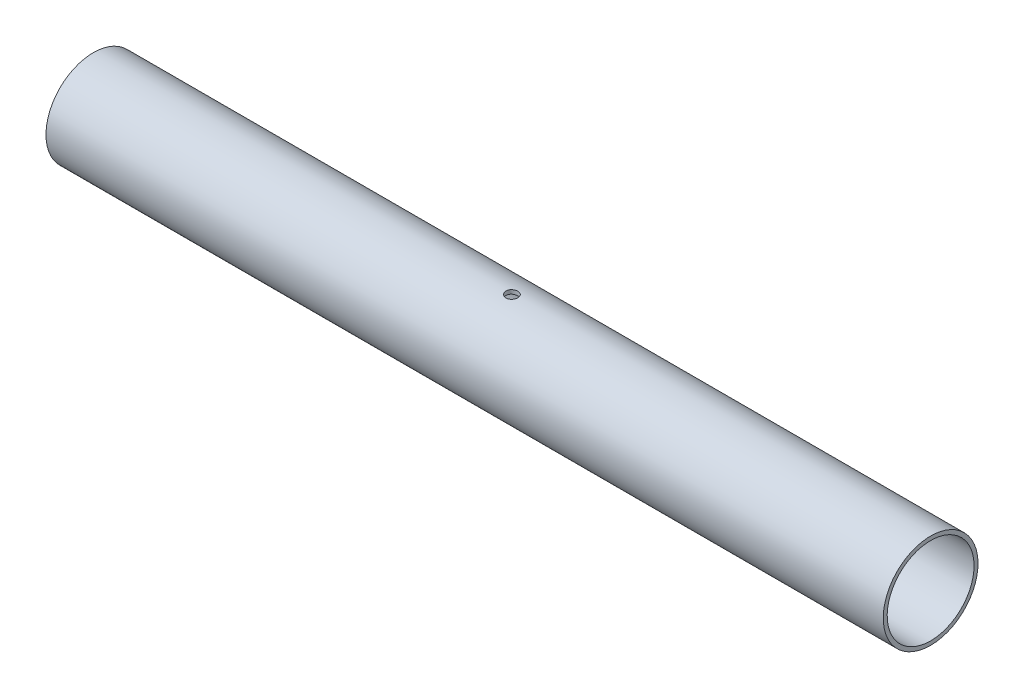
ISO-10303-21;
HEADER;
FILE_DESCRIPTION(('STEP AP214'),'2;1');
FILE_NAME('part.step','',(''),(''),'','','');
FILE_SCHEMA(('AUTOMOTIVE_DESIGN { 1 0 10303 214 1 1 1 1 }'));
ENDSEC;
DATA;
#1=APPLICATION_CONTEXT('core data for automotive mechanical design processes');
#2=APPLICATION_PROTOCOL_DEFINITION('international standard','automotive_design',2000,#1);
#3=PRODUCT_CONTEXT('',#1,'mechanical');
#4=PRODUCT('Part','Part','',(#3));
#5=PRODUCT_RELATED_PRODUCT_CATEGORY('part','',(#4));
#6=PRODUCT_DEFINITION_FORMATION('','',#4);
#7=PRODUCT_DEFINITION_CONTEXT('part definition',#1,'design');
#8=PRODUCT_DEFINITION('design','',#6,#7);
#9=PRODUCT_DEFINITION_SHAPE('','',#8);
#10=(LENGTH_UNIT() NAMED_UNIT(*) SI_UNIT(.MILLI.,.METRE.));
#11=(NAMED_UNIT(*) PLANE_ANGLE_UNIT() SI_UNIT($,.RADIAN.));
#12=(NAMED_UNIT(*) SI_UNIT($,.STERADIAN.) SOLID_ANGLE_UNIT());
#13=UNCERTAINTY_MEASURE_WITH_UNIT(LENGTH_MEASURE(1.E-05),#10,'distance_accuracy_value','');
#14=(GEOMETRIC_REPRESENTATION_CONTEXT(3) GLOBAL_UNCERTAINTY_ASSIGNED_CONTEXT((#13)) GLOBAL_UNIT_ASSIGNED_CONTEXT((#10,
#11,#12)) REPRESENTATION_CONTEXT('',''));
#15=CARTESIAN_POINT('',(0.,0.,0.));
#16=DIRECTION('',(0.,0.,1.));
#17=DIRECTION('',(1.,0.,0.));
#18=AXIS2_PLACEMENT_3D('',#15,#16,#17);
#19=CARTESIAN_POINT('',(90.4720943613365,105.869562715765,50.0000000000016));
#20=DIRECTION('',(-1.,0.,0.));
#21=DIRECTION('',(0.,-1.,0.));
#22=AXIS2_PLACEMENT_3D('',#19,#20,#21);
#23=CYLINDRICAL_SURFACE('',#22,12.);
#24=CARTESIAN_POINT('',(-17.0279056386635,93.869562715765,50.0000000000016));
#25=CARTESIAN_POINT('',(-17.027902074102,93.8695638863865,49.9160953426682));
#26=CARTESIAN_POINT('',(-17.0208419111619,93.8704520084356,49.83213825542));
#27=CARTESIAN_POINT('',(-16.992788985921,93.8739094750969,49.6665603187478));
#28=CARTESIAN_POINT('',(-16.9717816759094,93.8764805751165,49.5849420016274));
#29=CARTESIAN_POINT('',(-16.916463052315,93.8830143494986,49.4264626551138));
#30=CARTESIAN_POINT('',(-16.8821606935775,93.8869760870318,49.3495984639139));
#31=CARTESIAN_POINT('',(-16.8012452682816,93.8958505104965,49.2027323150658));
#32=CARTESIAN_POINT('',(-16.754634313545,93.9007630332604,49.1327291830678));
#33=CARTESIAN_POINT('',(-16.6501504687597,93.9110207879271,49.0011723098428));
#34=CARTESIAN_POINT('',(-16.5922233610557,93.9163680276106,48.9396617810393));
#35=CARTESIAN_POINT('',(-16.4668679445415,93.9268763597066,48.8272083238671));
#36=CARTESIAN_POINT('',(-16.3994391517155,93.9320374426194,48.7762659341663));
#37=CARTESIAN_POINT('',(-16.2567136521241,93.9416088820475,48.6862339032312));
#38=CARTESIAN_POINT('',(-16.1813912217227,93.9460166526976,48.647184742437));
#39=CARTESIAN_POINT('',(-16.025193407495,93.9535559450189,48.5823061540565));
#40=CARTESIAN_POINT('',(-15.9443182343753,93.9566875150862,48.5564762251625));
#41=CARTESIAN_POINT('',(-15.7797591213114,93.9613006781434,48.5189006119868));
#42=CARTESIAN_POINT('',(-15.696092084041,93.9627908151446,48.5070819711626));
#43=CARTESIAN_POINT('',(-15.5279498805804,93.9639785469083,48.4976386702673));
#44=CARTESIAN_POINT('',(-15.4434747470247,93.963676213756,48.5000134394002));
#45=CARTESIAN_POINT('',(-15.2766227423142,93.9613209835466,48.5188296581329));
#46=CARTESIAN_POINT('',(-15.1942366469433,93.9592780880031,48.5351907422108));
#47=CARTESIAN_POINT('',(-15.0333886259321,93.9536875172193,48.5813897700924));
#48=CARTESIAN_POINT('',(-14.954926779835,93.9501398114907,48.6112279869505));
#49=CARTESIAN_POINT('',(-14.8039048392505,93.9419280205772,48.6836206640546));
#50=CARTESIAN_POINT('',(-14.7313616585141,93.9372608764964,48.726210047777));
#51=CARTESIAN_POINT('',(-14.5944216220155,93.9273384471815,48.8228711183275));
#52=CARTESIAN_POINT('',(-14.5300251390793,93.9220831350511,48.8769433303531));
#53=CARTESIAN_POINT('',(-14.4107400122298,93.9115320564225,48.9954805335493));
#54=CARTESIAN_POINT('',(-14.3559201836039,93.9062362614437,49.0600147952976));
#55=CARTESIAN_POINT('',(-14.2578803106451,93.8962349204299,49.1974056985333));
#56=CARTESIAN_POINT('',(-14.2146602930603,93.891529375756,49.2702623592107));
#57=CARTESIAN_POINT('',(-14.1410468463851,93.8832358024536,49.4222829971835));
#58=CARTESIAN_POINT('',(-14.1106577263347,93.8796481493558,49.501449082799));
#59=CARTESIAN_POINT('',(-14.0636233425495,93.8739980010847,49.663815235743));
#60=CARTESIAN_POINT('',(-14.0469774353812,93.8719354345098,49.7470151140232));
#61=CARTESIAN_POINT('',(-14.0279911841071,93.8695771373005,49.9144921016535));
#62=CARTESIAN_POINT('',(-14.025556043245,93.8692696989092,49.9987583058824));
#63=CARTESIAN_POINT('',(-14.034810279097,93.8704246877325,50.1664976219001));
#64=CARTESIAN_POINT('',(-14.0464993550144,93.8718870772558,50.2499707505404));
#65=CARTESIAN_POINT('',(-14.0835914639281,93.8764101032249,50.4134747046345));
#66=CARTESIAN_POINT('',(-14.108949296705,93.8794654708818,50.4935159422564));
#67=CARTESIAN_POINT('',(-14.1726121098112,93.8868323771639,50.6482097929167));
#68=CARTESIAN_POINT('',(-14.2109175297583,93.8911439584413,50.7228622228808));
#69=CARTESIAN_POINT('',(-14.2996175211679,93.9005717783044,50.8650827124141));
#70=CARTESIAN_POINT('',(-14.3500734125468,93.90569205151,50.9326122559679));
#71=CARTESIAN_POINT('',(-14.461555337184,93.9161518618111,51.0582781937774));
#72=CARTESIAN_POINT('',(-14.5225817900141,93.9214914076037,51.1164142150037));
#73=CARTESIAN_POINT('',(-14.6538900887177,93.9318240829896,51.2219791752924));
#74=CARTESIAN_POINT('',(-14.7242226464497,93.9368150674371,51.2693452763424));
#75=CARTESIAN_POINT('',(-14.8719005855763,93.9458502495421,51.3515917336677));
#76=CARTESIAN_POINT('',(-14.9492458263494,93.9498944661789,51.3864723402386));
#77=CARTESIAN_POINT('',(-15.108550830152,93.9565636134071,51.4426559473215));
#78=CARTESIAN_POINT('',(-15.1904979366922,93.9591922446563,51.4639943764759));
#79=CARTESIAN_POINT('',(-15.3568471289319,93.9627432203203,51.4926019963223));
#80=CARTESIAN_POINT('',(-15.4412491002389,93.9636656441124,51.4998718415231));
#81=CARTESIAN_POINT('',(-15.6094869961863,93.9636974538703,51.5001239216525));
#82=CARTESIAN_POINT('',(-15.6933227876626,93.9628193672533,51.4932048786212));
#83=CARTESIAN_POINT('',(-15.8586299162705,93.9593760285418,51.4654846429112));
#84=CARTESIAN_POINT('',(-15.9401012531487,93.9568107762666,51.4446834487451));
#85=CARTESIAN_POINT('',(-16.0983538127233,93.9502860211177,51.3898202442154));
#86=CARTESIAN_POINT('',(-16.1751367056765,93.9463270182084,51.3557629885842));
#87=CARTESIAN_POINT('',(-16.3219136310924,93.9374600162961,51.2753641412918));
#88=CARTESIAN_POINT('',(-16.3919075784754,93.9325520054026,51.2290223957074));
#89=CARTESIAN_POINT('',(-16.5236243738677,93.9222990872516,51.1250037987611));
#90=CARTESIAN_POINT('',(-16.5852889152364,93.9169514832609,51.0672533754666));
#91=CARTESIAN_POINT('',(-16.6980897337642,93.9064457262077,50.9422101361826));
#92=CARTESIAN_POINT('',(-16.749223525128,93.9012876181115,50.8749150734866));
#93=CARTESIAN_POINT('',(-16.8396768529266,93.8917203762446,50.7323993725141));
#94=CARTESIAN_POINT('',(-16.878950722203,93.8873141652953,50.6571495677593));
#95=CARTESIAN_POINT('',(-16.9442483844132,93.8797768213047,50.5011097413824));
#96=CARTESIAN_POINT('',(-16.9702865744755,93.8766443035476,50.4203258485238));
#97=CARTESIAN_POINT('',(-17.0021412415662,93.8727623937986,50.2826034631824));
#98=CARTESIAN_POINT('',(-17.0117890038527,93.8715683603923,50.2265333981118));
#99=CARTESIAN_POINT('',(-17.0246723860794,93.8699681277899,50.1136502379291));
#100=CARTESIAN_POINT('',(-17.027908053303,93.8695619227842,50.0568371482992));
#101=CARTESIAN_POINT('',(-17.0279056386635,93.869562715765,50.0000000000016));
#102=B_SPLINE_CURVE_WITH_KNOTS('',3,(#24,#25,#26,#27,#28,#29,#30,#31,#32,#33,#34,#35,#36,#37,
#38,#39,#40,#41,#42,#43,#44,#45,#46,#47,#48,#49,#50,#51,#52,#53,#54,#55,#56,#57,#58,#59,#60,#61,
#62,#63,#64,#65,#66,#67,#68,#69,#70,#71,#72,#73,#74,#75,#76,#77,#78,#79,#80,#81,#82,#83,#84,#85,
#86,#87,#88,#89,#90,#91,#92,#93,#94,#95,#96,#97,#98,#99,#100,#101),.UNSPECIFIED.,.T.,.F.,(4,2,2,
2,2,2,2,2,2,2,2,2,2,2,2,2,2,2,2,2,2,2,2,2,2,2,2,2,2,2,2,2,2,2,2,2,2,2,4),(0.,0.251506363665746,
0.503275476566053,0.754875304909059,1.00643199354644,1.25922487921105,1.51203064680006,
1.76568750191322,2.01933473698084,2.27165535171792,2.52396581930798,2.77483617865015,
3.02571162099744,3.2772805577132,3.52886100308183,3.7821808688185,4.03550131867868,
4.28890677438963,4.54230036542268,4.79400167635153,5.04569762701157,5.29656632336038,
5.54744353847369,5.79961441757054,6.05179530825053,6.30541182904544,6.55902326532923,
6.81196844568555,7.06490185806374,7.31608140721328,7.56726098327729,7.81835054823893,
8.06944325947358,8.32221142615098,8.57503919082007,8.82882841822112,9.0823409921042,
9.25271305912577,9.42308386980263),.UNSPECIFIED.);
#103=CARTESIAN_POINT('',(-17.0279056386635,93.869562715765,50.0000000000016));
#104=VERTEX_POINT('',#103);
#105=EDGE_CURVE('E87',#104,#104,#102,.T.);
#106=ORIENTED_EDGE('',*,*,#105,.F.);
#107=EDGE_LOOP('',(#106));
#108=FACE_BOUND('',#107,.T.);
#109=CARTESIAN_POINT('',(-17.0279056386635,117.869562715765,50.0000000000016));
#110=CARTESIAN_POINT('',(-17.027902074102,117.869561545144,50.0839046573351));
#111=CARTESIAN_POINT('',(-17.0208419111619,117.868673423094,50.1678617445833));
#112=CARTESIAN_POINT('',(-16.992788985921,117.865215956433,50.3334396812555));
#113=CARTESIAN_POINT('',(-16.9717816759094,117.862644856414,50.4150579983759));
#114=CARTESIAN_POINT('',(-16.916463052315,117.856111082031,50.5735373448894));
#115=CARTESIAN_POINT('',(-16.8821606935775,117.852149344498,50.6504015360893));
#116=CARTESIAN_POINT('',(-16.8012452682816,117.843274921034,50.7972676849374));
#117=CARTESIAN_POINT('',(-16.754634313545,117.83836239827,50.8672708169354));
#118=CARTESIAN_POINT('',(-16.6501504687597,117.828104643603,50.9988276901604));
#119=CARTESIAN_POINT('',(-16.5922233610557,117.82275740392,51.0603382189639));
#120=CARTESIAN_POINT('',(-16.4668679445415,117.812249071824,51.1727916761361));
#121=CARTESIAN_POINT('',(-16.3994391517155,117.807087988911,51.223734065837));
#122=CARTESIAN_POINT('',(-16.2567136521241,117.797516549483,51.313766096772));
#123=CARTESIAN_POINT('',(-16.1813912217227,117.793108778833,51.3528152575663));
#124=CARTESIAN_POINT('',(-16.0251934074951,117.785569486511,51.4176938459467));
#125=CARTESIAN_POINT('',(-15.9443182343753,117.782437916444,51.4435237748407));
#126=CARTESIAN_POINT('',(-15.7797591213114,117.777824753387,51.4810993880165));
#127=CARTESIAN_POINT('',(-15.696092084041,117.776334616386,51.4929180288406));
#128=CARTESIAN_POINT('',(-15.5279498805804,117.775146884622,51.5023613297359));
#129=CARTESIAN_POINT('',(-15.4434747470247,117.775449217774,51.4999865606031));
#130=CARTESIAN_POINT('',(-15.2766227423142,117.777804447984,51.4811703418704));
#131=CARTESIAN_POINT('',(-15.1942366469433,117.779847343527,51.4648092577924));
#132=CARTESIAN_POINT('',(-15.0333886259321,117.785437914311,51.4186102299108));
#133=CARTESIAN_POINT('',(-14.954926779835,117.788985620039,51.3887720130528));
#134=CARTESIAN_POINT('',(-14.8039048392505,117.797197410953,51.3163793359486));
#135=CARTESIAN_POINT('',(-14.7313616585141,117.801864555034,51.2737899522262));
#136=CARTESIAN_POINT('',(-14.5944216220155,117.811786984349,51.1771288816758));
#137=CARTESIAN_POINT('',(-14.5300251390793,117.817042296479,51.1230566696501));
#138=CARTESIAN_POINT('',(-14.4107400122298,117.827593375108,51.0045194664539));
#139=CARTESIAN_POINT('',(-14.3559201836039,117.832889170086,50.9399852047056));
#140=CARTESIAN_POINT('',(-14.2578803106451,117.8428905111,50.80259430147));
#141=CARTESIAN_POINT('',(-14.2146602930603,117.847596055774,50.7297376407926));
#142=CARTESIAN_POINT('',(-14.1410468463851,117.855889629077,50.5777170028197));
#143=CARTESIAN_POINT('',(-14.1106577263347,117.859477282174,50.4985509172042));
#144=CARTESIAN_POINT('',(-14.0636233425495,117.865127430445,50.3361847642603));
#145=CARTESIAN_POINT('',(-14.0469774353812,117.86718999702,50.25298488598));
#146=CARTESIAN_POINT('',(-14.0279911841071,117.86954829423,50.0855078983497));
#147=CARTESIAN_POINT('',(-14.025556043245,117.869855732621,50.0012416941208));
#148=CARTESIAN_POINT('',(-14.034810279097,117.868700743798,49.8335023781031));
#149=CARTESIAN_POINT('',(-14.0464993550144,117.867238354274,49.7500292494628));
#150=CARTESIAN_POINT('',(-14.0835914639281,117.862715328305,49.5865252953687));
#151=CARTESIAN_POINT('',(-14.108949296705,117.859659960648,49.5064840577468));
#152=CARTESIAN_POINT('',(-14.1726121098112,117.852293054366,49.3517902070866));
#153=CARTESIAN_POINT('',(-14.2109175297583,117.847981473089,49.2771377771224));
#154=CARTESIAN_POINT('',(-14.2996175211679,117.838553653226,49.1349172875892));
#155=CARTESIAN_POINT('',(-14.3500734125468,117.83343338002,49.0673877440353));
#156=CARTESIAN_POINT('',(-14.461555337184,117.822973569719,48.9417218062258));
#157=CARTESIAN_POINT('',(-14.5225817900141,117.817634023926,48.8835857849995));
#158=CARTESIAN_POINT('',(-14.6538900887177,117.807301348541,48.7780208247108));
#159=CARTESIAN_POINT('',(-14.7242226464497,117.802310364093,48.7306547236609));
#160=CARTESIAN_POINT('',(-14.8719005855763,117.793275181988,48.6484082663355));
#161=CARTESIAN_POINT('',(-14.9492458263494,117.789230965351,48.6135276597646));
#162=CARTESIAN_POINT('',(-15.108550830152,117.782561818123,48.5573440526817));
#163=CARTESIAN_POINT('',(-15.1904979366922,117.779933186874,48.5360056235273));
#164=CARTESIAN_POINT('',(-15.3568471289319,117.77638221121,48.5073980036809));
#165=CARTESIAN_POINT('',(-15.4412491002389,117.775459787418,48.5001281584802));
#166=CARTESIAN_POINT('',(-15.6094869961863,117.77542797766,48.4998760783507));
#167=CARTESIAN_POINT('',(-15.6933227876626,117.776306064277,48.506795121382));
#168=CARTESIAN_POINT('',(-15.8586299162705,117.779749402988,48.534515357092));
#169=CARTESIAN_POINT('',(-15.9401012531487,117.782314655264,48.5553165512581));
#170=CARTESIAN_POINT('',(-16.0983538127233,117.788839410412,48.6101797557878));
#171=CARTESIAN_POINT('',(-16.1751367056765,117.792798413322,48.6442370114191));
#172=CARTESIAN_POINT('',(-16.3219136310924,117.801665415234,48.7246358587114));
#173=CARTESIAN_POINT('',(-16.3919075784754,117.806573426127,48.7709776042959));
#174=CARTESIAN_POINT('',(-16.5236243738678,117.816826344278,48.8749962012421));
#175=CARTESIAN_POINT('',(-16.5852889152365,117.822173948269,48.9327466245366));
#176=CARTESIAN_POINT('',(-16.6980897337642,117.832679705322,49.0577898638206));
#177=CARTESIAN_POINT('',(-16.749223525128,117.837837813419,49.1250849265167));
#178=CARTESIAN_POINT('',(-16.8396768529266,117.847405055286,49.2676006274891));
#179=CARTESIAN_POINT('',(-16.878950722203,117.851811266235,49.3428504322439));
#180=CARTESIAN_POINT('',(-16.9442483844132,117.859348610225,49.4988902586208));
#181=CARTESIAN_POINT('',(-16.9702865744755,117.862481127982,49.5796741514795));
#182=CARTESIAN_POINT('',(-17.0021412415662,117.866363037732,49.7173965368209));
#183=CARTESIAN_POINT('',(-17.0117890038527,117.867557071138,49.7734666018915));
#184=CARTESIAN_POINT('',(-17.0246723860794,117.86915730374,49.8863497620741));
#185=CARTESIAN_POINT('',(-17.027908053303,117.869563508746,49.943162851704));
#186=CARTESIAN_POINT('',(-17.0279056386635,117.869562715765,50.0000000000016));
#187=B_SPLINE_CURVE_WITH_KNOTS('',3,(#109,#110,#111,#112,#113,#114,#115,#116,#117,#118,#119,
#120,#121,#122,#123,#124,#125,#126,#127,#128,#129,#130,#131,#132,#133,#134,#135,#136,#137,#138,
#139,#140,#141,#142,#143,#144,#145,#146,#147,#148,#149,#150,#151,#152,#153,#154,#155,#156,#157,
#158,#159,#160,#161,#162,#163,#164,#165,#166,#167,#168,#169,#170,#171,#172,#173,#174,#175,#176,
#177,#178,#179,#180,#181,#182,#183,#184,#185,#186),.UNSPECIFIED.,.T.,.F.,(4,2,2,2,2,2,2,2,2,2,2,
2,2,2,2,2,2,2,2,2,2,2,2,2,2,2,2,2,2,2,2,2,2,2,2,2,2,2,4),(0.,0.251506363665746,
0.503275476566052,0.754875304909059,1.00643199354644,1.25922487921105,1.51203064680006,
1.76568750191321,2.01933473698084,2.27165535171792,2.52396581930798,2.77483617865015,
3.02571162099744,3.27728055771319,3.52886100308183,3.78218086881849,4.03550131867868,
4.28890677438963,4.54230036542268,4.79400167635154,5.04569762701157,5.29656632336037,
5.54744353847368,5.79961441757053,6.05179530825052,6.30541182904543,6.55902326532923,
6.81196844568554,7.06490185806373,7.31608140721328,7.56726098327728,7.81835054823893,
8.06944325947358,8.32221142615098,8.57503919082008,8.82882841822112,9.0823409921042,
9.25271305912578,9.42308386980262),.UNSPECIFIED.);
#188=CARTESIAN_POINT('',(-17.0279056386635,117.869562715765,50.0000000000016));
#189=VERTEX_POINT('',#188);
#190=EDGE_CURVE('E81',#189,#189,#187,.T.);
#191=ORIENTED_EDGE('',*,*,#190,.F.);
#192=EDGE_LOOP('',(#191));
#193=FACE_BOUND('',#192,.T.);
#194=CARTESIAN_POINT('',(90.4720943613365,105.869562715765,50.0000000000016));
#195=DIRECTION('',(-1.,0.,0.));
#196=DIRECTION('',(0.,-1.,0.));
#197=AXIS2_PLACEMENT_3D('',#194,#195,#196);
#198=CIRCLE('',#197,12.);
#199=CARTESIAN_POINT('',(90.4720943613365,93.8695627157651,50.0000000000016));
#200=VERTEX_POINT('',#199);
#201=EDGE_CURVE('E10',#200,#200,#198,.T.);
#202=ORIENTED_EDGE('',*,*,#201,.T.);
#203=EDGE_LOOP('',(#202));
#204=FACE_BOUND('',#203,.T.);
#205=CARTESIAN_POINT('',(-121.527905638663,105.869562715765,50.0000000000016));
#206=DIRECTION('',(-1.,0.,0.));
#207=DIRECTION('',(0.,-1.,0.));
#208=AXIS2_PLACEMENT_3D('',#205,#206,#207);
#209=CIRCLE('',#208,12.);
#210=CARTESIAN_POINT('',(-121.527905638663,93.869562715765,50.0000000000016));
#211=VERTEX_POINT('',#210);
#212=EDGE_CURVE('E51',#211,#211,#209,.T.);
#213=ORIENTED_EDGE('',*,*,#212,.F.);
#214=EDGE_LOOP('',(#213));
#215=FACE_BOUND('',#214,.T.);
#216=ADVANCED_FACE('F37',(#108,#193,#204,#215),#23,.T.);
#217=CARTESIAN_POINT('',(90.4720943613365,105.869562715765,50.0000000000016));
#218=DIRECTION('',(-1.,0.,0.));
#219=DIRECTION('',(0.,-1.,0.));
#220=AXIS2_PLACEMENT_3D('',#217,#218,#219);
#221=PLANE('',#220);
#222=CARTESIAN_POINT('',(90.4720943613365,105.869562715765,50.0000000000016));
#223=DIRECTION('',(-1.,0.,0.));
#224=DIRECTION('',(0.,-1.,0.));
#225=AXIS2_PLACEMENT_3D('',#222,#223,#224);
#226=CIRCLE('',#225,11.);
#227=CARTESIAN_POINT('',(90.4720943613365,94.8695627157651,50.0000000000016));
#228=VERTEX_POINT('',#227);
#229=EDGE_CURVE('E57',#228,#228,#226,.T.);
#230=ORIENTED_EDGE('',*,*,#229,.T.);
#231=EDGE_LOOP('',(#230));
#232=FACE_BOUND('',#231,.T.);
#233=ORIENTED_EDGE('',*,*,#201,.F.);
#234=EDGE_LOOP('',(#233));
#235=FACE_BOUND('',#234,.T.);
#236=ADVANCED_FACE('F105',(#232,#235),#221,.F.);
#237=CARTESIAN_POINT('',(-121.527905638663,105.869562715765,50.0000000000016));
#238=DIRECTION('',(-1.,0.,0.));
#239=DIRECTION('',(0.,-1.,0.));
#240=AXIS2_PLACEMENT_3D('',#237,#238,#239);
#241=PLANE('',#240);
#242=CARTESIAN_POINT('',(-121.527905638663,105.869562715765,50.0000000000016));
#243=DIRECTION('',(-1.,0.,0.));
#244=DIRECTION('',(0.,-1.,0.));
#245=AXIS2_PLACEMENT_3D('',#242,#243,#244);
#246=CIRCLE('',#245,11.);
#247=CARTESIAN_POINT('',(-121.527905638663,94.869562715765,50.0000000000016));
#248=VERTEX_POINT('',#247);
#249=EDGE_CURVE('E60',#248,#248,#246,.T.);
#250=ORIENTED_EDGE('',*,*,#249,.F.);
#251=EDGE_LOOP('',(#250));
#252=FACE_BOUND('',#251,.T.);
#253=ORIENTED_EDGE('',*,*,#212,.T.);
#254=EDGE_LOOP('',(#253));
#255=FACE_BOUND('',#254,.T.);
#256=ADVANCED_FACE('F102',(#252,#255),#241,.T.);
#257=CARTESIAN_POINT('',(90.4720943613365,105.869562715765,50.0000000000016));
#258=DIRECTION('',(-1.,0.,0.));
#259=DIRECTION('',(0.,-1.,0.));
#260=AXIS2_PLACEMENT_3D('',#257,#258,#259);
#261=CYLINDRICAL_SURFACE('',#260,11.);
#262=CARTESIAN_POINT('',(-14.0279056386635,94.869562715765,50.0000000000016));
#263=CARTESIAN_POINT('',(-14.0279091581208,94.8695639690389,50.0838384134315));
#264=CARTESIAN_POINT('',(-14.034958231336,94.8705312886163,50.1677276022914));
#265=CARTESIAN_POINT('',(-14.0629645218877,94.8742970516805,50.333167097643));
#266=CARTESIAN_POINT('',(-14.0839358381133,94.8770973513641,50.4147149456615));
#267=CARTESIAN_POINT('',(-14.1391533725041,94.8842139417822,50.5730530936952));
#268=CARTESIAN_POINT('',(-14.1733901778655,94.8885291573731,50.6498467224548));
#269=CARTESIAN_POINT('',(-14.2541451632237,94.8981969885421,50.7965853024513));
#270=CARTESIAN_POINT('',(-14.3006614109177,94.9035494408645,50.8665313288603));
#271=CARTESIAN_POINT('',(-14.4049778529558,94.9147341160725,50.9980575638139));
#272=CARTESIAN_POINT('',(-14.4628420616669,94.9205689467128,51.0595867846254));
#273=CARTESIAN_POINT('',(-14.5880742494559,94.9320400001719,51.1720933390821));
#274=CARTESIAN_POINT('',(-14.6554427385248,94.9376762123126,51.2230701061296));
#275=CARTESIAN_POINT('',(-14.7981075768876,94.9481373380462,51.3132185052508));
#276=CARTESIAN_POINT('',(-14.8734348236687,94.952958885657,51.3523416646856));
#277=CARTESIAN_POINT('',(-15.0296674540371,94.9612097750875,51.4173626448544));
#278=CARTESIAN_POINT('',(-15.1105725862733,94.9646391795921,51.4432610610815));
#279=CARTESIAN_POINT('',(-15.2751318822371,94.9696922188434,51.4809409055525));
#280=CARTESIAN_POINT('',(-15.3587658579545,94.9713269335202,51.4928089886471));
#281=CARTESIAN_POINT('',(-15.5268531116875,94.9726392777168,51.5023595505983));
#282=CARTESIAN_POINT('',(-15.6113063504962,94.9723170004342,51.5000427049814));
#283=CARTESIAN_POINT('',(-15.7780273642644,94.9697619123995,51.481360170194));
#284=CARTESIAN_POINT('',(-15.8603061150306,94.9675421447454,51.4650903891775));
#285=CARTESIAN_POINT('',(-16.0209546791961,94.9614625416832,51.4191136769546));
#286=CARTESIAN_POINT('',(-16.0993243996764,94.95760266731,51.3894064265041));
#287=CARTESIAN_POINT('',(-16.2502255647011,94.9486631328281,51.3172964176037));
#288=CARTESIAN_POINT('',(-16.3227370679315,94.9435795230076,51.2748524385792));
#289=CARTESIAN_POINT('',(-16.4596447875492,94.9327682724182,51.1785032304498));
#290=CARTESIAN_POINT('',(-16.5240405624302,94.9270405966433,51.124597378232));
#291=CARTESIAN_POINT('',(-16.643445193158,94.9155287418671,51.0063252778396));
#292=CARTESIAN_POINT('',(-16.6983722789759,94.9097444863542,50.9418764507358));
#293=CARTESIAN_POINT('',(-16.7966421302618,94.8988152451871,50.804630944407));
#294=CARTESIAN_POINT('',(-16.8399848596265,94.8936702615253,50.7318342391663));
#295=CARTESIAN_POINT('',(-16.9138575018435,94.8845951748879,50.5798929694821));
#296=CARTESIAN_POINT('',(-16.9443817810562,94.8806656062803,50.5007456321329));
#297=CARTESIAN_POINT('',(-16.9916834766091,94.8744687637344,50.3383830879415));
#298=CARTESIAN_POINT('',(-17.008461659757,94.872201397073,50.2551681082818));
#299=CARTESIAN_POINT('',(-17.027687723229,94.8695965777275,50.0877389073693));
#300=CARTESIAN_POINT('',(-17.0302481472521,94.8692439688637,50.0035378363895));
#301=CARTESIAN_POINT('',(-17.0212637603327,94.8704673280552,49.8359077059124));
#302=CARTESIAN_POINT('',(-17.0097193083805,94.8720432470267,49.7524786268212));
#303=CARTESIAN_POINT('',(-16.9729464154538,94.8769371891859,49.5890966216367));
#304=CARTESIAN_POINT('',(-16.9477721430921,94.8802483145319,49.5091312793811));
#305=CARTESIAN_POINT('',(-16.8845108796306,94.8882422751287,49.354556858906));
#306=CARTESIAN_POINT('',(-16.8464233756463,94.8929251648619,49.2799479935764));
#307=CARTESIAN_POINT('',(-16.7581480999394,94.9031790854047,49.1377051070192));
#308=CARTESIAN_POINT('',(-16.7078881358631,94.9087553451941,49.0701162716484));
#309=CARTESIAN_POINT('',(-16.5967960607061,94.9201571843383,48.944292986747));
#310=CARTESIAN_POINT('',(-16.5359634466068,94.9259827755458,48.8860589825483));
#311=CARTESIAN_POINT('',(-16.4049548056551,94.9372740280348,48.7801946704605));
#312=CARTESIAN_POINT('',(-16.3347179251824,94.9427369656437,48.7326393361952));
#313=CARTESIAN_POINT('',(-16.1871873309637,94.9526380653234,48.650001604509));
#314=CARTESIAN_POINT('',(-16.1098937808049,94.9570762511416,48.6149189180402));
#315=CARTESIAN_POINT('',(-15.9506778819903,94.9644062431584,48.5583415049501));
#316=CARTESIAN_POINT('',(-15.8687703442273,94.967302716793,48.5368057295015));
#317=CARTESIAN_POINT('',(-15.7024591168354,94.9712342841628,48.5078018945264));
#318=CARTESIAN_POINT('',(-15.6180555676491,94.9722694824241,48.5003330450226));
#319=CARTESIAN_POINT('',(-15.4498946632725,94.9723578616123,48.4996914341544));
#320=CARTESIAN_POINT('',(-15.3661377420551,94.9714273771445,48.5064008530952));
#321=CARTESIAN_POINT('',(-15.200954499965,94.9677245152286,48.5336745356163));
#322=CARTESIAN_POINT('',(-15.1195281777623,94.9649521388316,48.5542387912897));
#323=CARTESIAN_POINT('',(-14.9613404992783,94.9578832075672,48.6085994354968));
#324=CARTESIAN_POINT('',(-14.8845767711809,94.9535874353721,48.6423890301947));
#325=CARTESIAN_POINT('',(-14.7377893400571,94.94395460452,48.7222296016104));
#326=CARTESIAN_POINT('',(-14.6677657844029,94.9386175231028,48.7682808463434));
#327=CARTESIAN_POINT('',(-14.5358456020637,94.9274504165466,48.8717708477708));
#328=CARTESIAN_POINT('',(-14.4740180024409,94.9216168101615,48.9292972157676));
#329=CARTESIAN_POINT('',(-14.3608502919527,94.9101448427295,49.053920131948));
#330=CARTESIAN_POINT('',(-14.3095126403521,94.9045065277235,49.1210189180438));
#331=CARTESIAN_POINT('',(-14.2185796712801,94.8940317860658,49.2632345067996));
#332=CARTESIAN_POINT('',(-14.1790384803871,94.8891990993088,49.3383861814843));
#333=CARTESIAN_POINT('',(-14.1131961576105,94.8809173451935,49.4942903060713));
#334=CARTESIAN_POINT('',(-14.0868809289698,94.8774668054878,49.5750366879797));
#335=CARTESIAN_POINT('',(-14.0543952015995,94.873150955092,49.7134814029144));
#336=CARTESIAN_POINT('',(-14.0444762778661,94.8718120729764,49.7703142113055));
#337=CARTESIAN_POINT('',(-14.0312303176822,94.8700175266912,49.8847566863547));
#338=CARTESIAN_POINT('',(-14.0279032192571,94.8695618542178,49.9423663457039));
#339=CARTESIAN_POINT('',(-14.0279056386635,94.869562715765,50.0000000000016));
#340=B_SPLINE_CURVE_WITH_KNOTS('',3,(#262,#263,#264,#265,#266,#267,#268,#269,#270,#271,#272,
#273,#274,#275,#276,#277,#278,#279,#280,#281,#282,#283,#284,#285,#286,#287,#288,#289,#290,#291,
#292,#293,#294,#295,#296,#297,#298,#299,#300,#301,#302,#303,#304,#305,#306,#307,#308,#309,#310,
#311,#312,#313,#314,#315,#316,#317,#318,#319,#320,#321,#322,#323,#324,#325,#326,#327,#328,#329,
#330,#331,#332,#333,#334,#335,#336,#337,#338,#339),.UNSPECIFIED.,.T.,.F.,(4,2,2,2,2,2,2,2,2,2,2,
2,2,2,2,2,2,2,2,2,2,2,2,2,2,2,2,2,2,2,2,2,2,2,2,2,2,2,4),(0.,0.25130468808615,0.502864258429492,
0.754245655375319,1.00558751830525,1.25839025869503,1.51120656941612,1.76504317927172,
2.0188683581839,2.27111752000618,2.52335466910192,2.77387178872724,3.02439486038875,
3.27573762185034,3.52709405079555,3.78052284746839,4.0339524339601,4.28749328511462,
4.5410199918667,4.79253696204824,5.04404753088009,5.29456578809543,5.54509399649482,
5.79714607697892,6.04921015271754,6.30299215129408,6.5567682682073,6.80977166004953,
7.0627608431786,7.31365598745061,7.56455098853992,7.81531727406241,8.0660890412842,
8.31885423544369,8.5716786200941,8.82564582024679,9.07934175494259,9.25209960062622,
9.42485582207675),.UNSPECIFIED.);
#341=CARTESIAN_POINT('',(-14.0279056386635,94.869562715765,50.0000000000016));
#342=VERTEX_POINT('',#341);
#343=EDGE_CURVE('E41',#342,#342,#340,.T.);
#344=ORIENTED_EDGE('',*,*,#343,.T.);
#345=EDGE_LOOP('',(#344));
#346=FACE_BOUND('',#345,.T.);
#347=CARTESIAN_POINT('',(-17.0279056386635,116.869562715765,50.0000000000016));
#348=CARTESIAN_POINT('',(-17.0279021192061,116.869561462491,50.0838384134315));
#349=CARTESIAN_POINT('',(-17.0208530459909,116.868594142914,50.1677276022914));
#350=CARTESIAN_POINT('',(-16.9928467554392,116.86482837985,50.333167097643));
#351=CARTESIAN_POINT('',(-16.9718754392136,116.862028080166,50.4147149456615));
#352=CARTESIAN_POINT('',(-16.9166579048228,116.854911489748,50.5730530936952));
#353=CARTESIAN_POINT('',(-16.8824210994614,116.850596274157,50.6498467224548));
#354=CARTESIAN_POINT('',(-16.8016661141033,116.840928442988,50.7965853024513));
#355=CARTESIAN_POINT('',(-16.7551498664092,116.835575990666,50.8665313288603));
#356=CARTESIAN_POINT('',(-16.6508334243712,116.824391315458,50.9980575638139));
#357=CARTESIAN_POINT('',(-16.59296921566,116.818556484817,51.0595867846254));
#358=CARTESIAN_POINT('',(-16.4677370278711,116.807085431358,51.1720933390821));
#359=CARTESIAN_POINT('',(-16.4003685388021,116.801449219218,51.2230701061296));
#360=CARTESIAN_POINT('',(-16.2577037004394,116.790988093484,51.3132185052508));
#361=CARTESIAN_POINT('',(-16.1823764536582,116.786166545873,51.3523416646856));
#362=CARTESIAN_POINT('',(-16.0261438232898,116.777915656443,51.4173626448544));
#363=CARTESIAN_POINT('',(-15.9452386910537,116.774486251938,51.4432610610815));
#364=CARTESIAN_POINT('',(-15.7806793950899,116.769433212687,51.4809409055525));
#365=CARTESIAN_POINT('',(-15.6970454193724,116.76779849801,51.4928089886471));
#366=CARTESIAN_POINT('',(-15.5289581656394,116.766486153813,51.5023595505983));
#367=CARTESIAN_POINT('',(-15.4445049268307,116.766808431096,51.5000427049814));
#368=CARTESIAN_POINT('',(-15.2777839130626,116.769363519131,51.481360170194));
#369=CARTESIAN_POINT('',(-15.1955051622963,116.771583286785,51.4650903891775));
#370=CARTESIAN_POINT('',(-15.0348565981308,116.777662889847,51.4191136769546));
#371=CARTESIAN_POINT('',(-14.9564868776505,116.78152276422,51.3894064265041));
#372=CARTESIAN_POINT('',(-14.8055857126258,116.790462298702,51.3172964176037));
#373=CARTESIAN_POINT('',(-14.7330742093954,116.795545908523,51.2748524385792));
#374=CARTESIAN_POINT('',(-14.5961664897777,116.806357159112,51.1785032304498));
#375=CARTESIAN_POINT('',(-14.5317707148967,116.812084834887,51.124597378232));
#376=CARTESIAN_POINT('',(-14.4123660841689,116.823596689663,51.0063252778396));
#377=CARTESIAN_POINT('',(-14.357438998351,116.829380945176,50.9418764507358));
#378=CARTESIAN_POINT('',(-14.2591691470651,116.840310186343,50.804630944407));
#379=CARTESIAN_POINT('',(-14.2158264177004,116.845455170005,50.7318342391663));
#380=CARTESIAN_POINT('',(-14.1419537754834,116.854530256642,50.5798929694821));
#381=CARTESIAN_POINT('',(-14.1114294962707,116.85845982525,50.5007456321329));
#382=CARTESIAN_POINT('',(-14.0641278007179,116.864656667796,50.3383830879415));
#383=CARTESIAN_POINT('',(-14.04734961757,116.866924034457,50.2551681082817));
#384=CARTESIAN_POINT('',(-14.0281235540979,116.869528853803,50.0877389073693));
#385=CARTESIAN_POINT('',(-14.0255631300749,116.869881462666,50.0035378363895));
#386=CARTESIAN_POINT('',(-14.0345475169942,116.868658103475,49.8359077059124));
#387=CARTESIAN_POINT('',(-14.0460919689464,116.867082184503,49.7524786268212));
#388=CARTESIAN_POINT('',(-14.0828648618731,116.862188242344,49.5890966216367));
#389=CARTESIAN_POINT('',(-14.1080391342348,116.858877116998,49.5091312793811));
#390=CARTESIAN_POINT('',(-14.1713003976964,116.850883156401,49.354556858906));
#391=CARTESIAN_POINT('',(-14.2093879016806,116.846200266668,49.2799479935764));
#392=CARTESIAN_POINT('',(-14.2976631773875,116.835946346125,49.1377051070192));
#393=CARTESIAN_POINT('',(-14.3479231414638,116.830370086336,49.0701162716484));
#394=CARTESIAN_POINT('',(-14.4590152166208,116.818968247192,48.944292986747));
#395=CARTESIAN_POINT('',(-14.5198478307201,116.813142655984,48.8860589825483));
#396=CARTESIAN_POINT('',(-14.6508564716719,116.801851403495,48.7801946704605));
#397=CARTESIAN_POINT('',(-14.7210933521445,116.796388465886,48.7326393361952));
#398=CARTESIAN_POINT('',(-14.8686239463632,116.786487366207,48.650001604509));
#399=CARTESIAN_POINT('',(-14.945917496522,116.782049180388,48.6149189180402));
#400=CARTESIAN_POINT('',(-15.1051333953366,116.774719188372,48.5583415049501));
#401=CARTESIAN_POINT('',(-15.1870409330996,116.771822714737,48.5368057295015));
#402=CARTESIAN_POINT('',(-15.3533521604915,116.767891147367,48.5078018945264));
#403=CARTESIAN_POINT('',(-15.4377557096778,116.766855949106,48.5003330450226));
#404=CARTESIAN_POINT('',(-15.6059166140544,116.766767569918,48.4996914341544));
#405=CARTESIAN_POINT('',(-15.6896735352719,116.767698054386,48.5064008530952));
#406=CARTESIAN_POINT('',(-15.8548567773619,116.771400916302,48.5336745356163));
#407=CARTESIAN_POINT('',(-15.9362830995646,116.774173292699,48.5542387912897));
#408=CARTESIAN_POINT('',(-16.0944707780486,116.781242223963,48.6085994354968));
#409=CARTESIAN_POINT('',(-16.171234506146,116.785537996158,48.6423890301947));
#410=CARTESIAN_POINT('',(-16.3180219372698,116.79517082701,48.7222296016104));
#411=CARTESIAN_POINT('',(-16.388045492924,116.800507908427,48.7682808463434));
#412=CARTESIAN_POINT('',(-16.5199656752632,116.811675014984,48.8717708477708));
#413=CARTESIAN_POINT('',(-16.581793274886,116.817508621369,48.9292972157676));
#414=CARTESIAN_POINT('',(-16.6949609853742,116.828980588801,49.053920131948));
#415=CARTESIAN_POINT('',(-16.7462986369748,116.834618903807,49.1210189180438));
#416=CARTESIAN_POINT('',(-16.8372316060468,116.845093645464,49.2632345067996));
#417=CARTESIAN_POINT('',(-16.8767727969398,116.849926332221,49.3383861814843));
#418=CARTESIAN_POINT('',(-16.9426151197164,116.858208086337,49.4942903060713));
#419=CARTESIAN_POINT('',(-16.9689303483572,116.861658626042,49.5750366879797));
#420=CARTESIAN_POINT('',(-17.0014160757274,116.865974476438,49.7134814029144));
#421=CARTESIAN_POINT('',(-17.0113349994608,116.867313358554,49.7703142113055));
#422=CARTESIAN_POINT('',(-17.0245809596447,116.869107904839,49.8847566863547));
#423=CARTESIAN_POINT('',(-17.0279080580698,116.869563577312,49.9423663457039));
#424=CARTESIAN_POINT('',(-17.0279056386635,116.869562715765,50.0000000000016));
#425=B_SPLINE_CURVE_WITH_KNOTS('',3,(#347,#348,#349,#350,#351,#352,#353,#354,#355,#356,#357,
#358,#359,#360,#361,#362,#363,#364,#365,#366,#367,#368,#369,#370,#371,#372,#373,#374,#375,#376,
#377,#378,#379,#380,#381,#382,#383,#384,#385,#386,#387,#388,#389,#390,#391,#392,#393,#394,#395,
#396,#397,#398,#399,#400,#401,#402,#403,#404,#405,#406,#407,#408,#409,#410,#411,#412,#413,#414,
#415,#416,#417,#418,#419,#420,#421,#422,#423,#424),.UNSPECIFIED.,.T.,.F.,(4,2,2,2,2,2,2,2,2,2,2,
2,2,2,2,2,2,2,2,2,2,2,2,2,2,2,2,2,2,2,2,2,2,2,2,2,2,2,4),(0.,0.25130468808615,0.502864258429492,
0.754245655375319,1.00558751830525,1.25839025869504,1.51120656941612,1.76504317927173,
2.01886835818389,2.27111752000618,2.52335466910192,2.77387178872724,3.02439486038875,
3.27573762185034,3.52709405079555,3.78052284746839,4.03395243396009,4.28749328511462,
4.54101999186671,4.79253696204824,5.04404753088008,5.29456578809543,5.54509399649482,
5.79714607697891,6.04921015271753,6.30299215129407,6.55676826820729,6.80977166004952,
7.0627608431786,7.3136559874506,7.56455098853992,7.81531727406241,8.0660890412842,
8.31885423544368,8.5716786200941,8.82564582024678,9.07934175494259,9.25209960062622,
9.42485582207674),.UNSPECIFIED.);
#426=CARTESIAN_POINT('',(-17.0279056386635,116.869562715765,50.0000000000016));
#427=VERTEX_POINT('',#426);
#428=EDGE_CURVE('E62',#427,#427,#425,.T.);
#429=ORIENTED_EDGE('',*,*,#428,.T.);
#430=EDGE_LOOP('',(#429));
#431=FACE_BOUND('',#430,.T.);
#432=ORIENTED_EDGE('',*,*,#229,.F.);
#433=EDGE_LOOP('',(#432));
#434=FACE_BOUND('',#433,.T.);
#435=ORIENTED_EDGE('',*,*,#249,.T.);
#436=EDGE_LOOP('',(#435));
#437=FACE_BOUND('',#436,.T.);
#438=ADVANCED_FACE('F68',(#346,#431,#434,#437),#261,.F.);
#439=CARTESIAN_POINT('',(-15.5279056386635,93.869562715765,50.0000000000016));
#440=DIRECTION('',(0.,1.,0.));
#441=DIRECTION('',(-1.,0.,0.));
#442=AXIS2_PLACEMENT_3D('',#439,#440,#441);
#443=CYLINDRICAL_SURFACE('',#442,1.5);
#444=ORIENTED_EDGE('',*,*,#190,.T.);
#445=EDGE_LOOP('',(#444));
#446=FACE_BOUND('',#445,.T.);
#447=ORIENTED_EDGE('',*,*,#428,.F.);
#448=EDGE_LOOP('',(#447));
#449=FACE_BOUND('',#448,.T.);
#450=ADVANCED_FACE('F74',(#446,#449),#443,.F.);
#451=ORIENTED_EDGE('',*,*,#105,.T.);
#452=EDGE_LOOP('',(#451));
#453=FACE_BOUND('',#452,.T.);
#454=ORIENTED_EDGE('',*,*,#343,.F.);
#455=EDGE_LOOP('',(#454));
#456=FACE_BOUND('',#455,.T.);
#457=ADVANCED_FACE('F71',(#453,#456),#443,.F.);
#458=CLOSED_SHELL('',(#216,#236,#256,#438,#450,#457));
#459=MANIFOLD_SOLID_BREP('B2',#458);
#460=ADVANCED_BREP_SHAPE_REPRESENTATION('',(#18,#459),#14);
#461=SHAPE_DEFINITION_REPRESENTATION(#9,#460);
ENDSEC;
END-ISO-10303-21;
